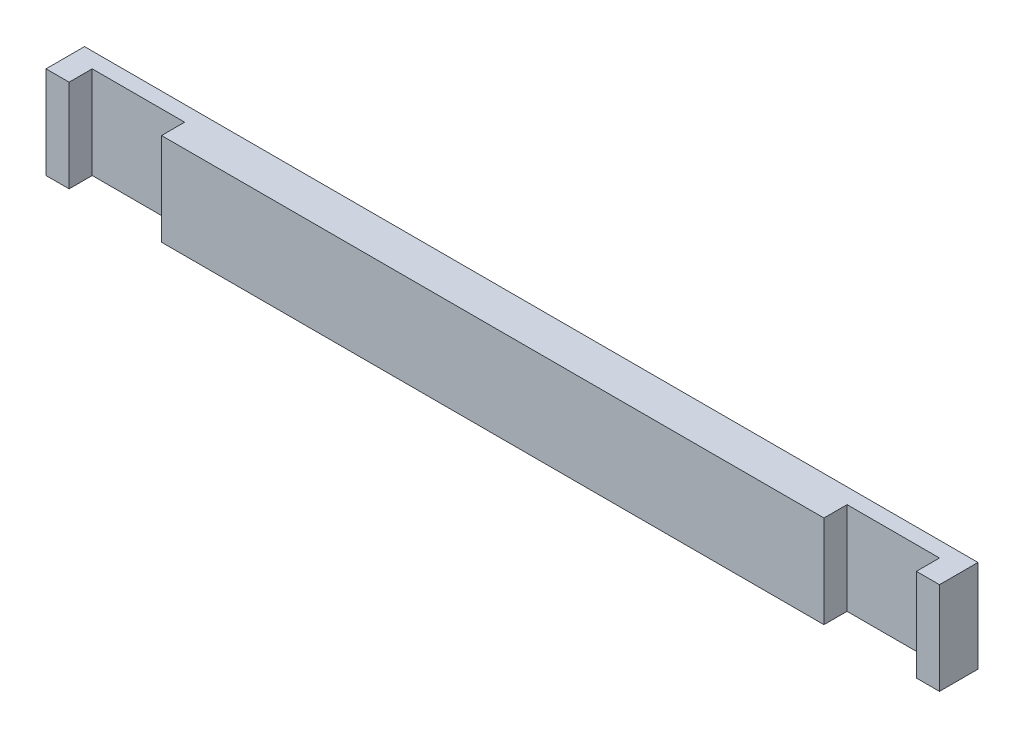
ISO-10303-21;
HEADER;
FILE_DESCRIPTION(('STEP AP214'),'2;1');
FILE_NAME('part.step','',(''),(''),'','','');
FILE_SCHEMA(('AUTOMOTIVE_DESIGN { 1 0 10303 214 1 1 1 1 }'));
ENDSEC;
DATA;
#1=APPLICATION_CONTEXT('core data for automotive mechanical design processes');
#2=APPLICATION_PROTOCOL_DEFINITION('international standard','automotive_design',2000,#1);
#3=PRODUCT_CONTEXT('',#1,'mechanical');
#4=PRODUCT('Part','Part','',(#3));
#5=PRODUCT_RELATED_PRODUCT_CATEGORY('part','',(#4));
#6=PRODUCT_DEFINITION_FORMATION('','',#4);
#7=PRODUCT_DEFINITION_CONTEXT('part definition',#1,'design');
#8=PRODUCT_DEFINITION('design','',#6,#7);
#9=PRODUCT_DEFINITION_SHAPE('','',#8);
#10=(LENGTH_UNIT() NAMED_UNIT(*) SI_UNIT(.MILLI.,.METRE.));
#11=(NAMED_UNIT(*) PLANE_ANGLE_UNIT() SI_UNIT($,.RADIAN.));
#12=(NAMED_UNIT(*) SI_UNIT($,.STERADIAN.) SOLID_ANGLE_UNIT());
#13=UNCERTAINTY_MEASURE_WITH_UNIT(LENGTH_MEASURE(1.E-05),#10,'distance_accuracy_value','');
#14=(GEOMETRIC_REPRESENTATION_CONTEXT(3) GLOBAL_UNCERTAINTY_ASSIGNED_CONTEXT((#13)) GLOBAL_UNIT_ASSIGNED_CONTEXT((#10,
#11,#12)) REPRESENTATION_CONTEXT('',''));
#15=CARTESIAN_POINT('',(0.,0.,0.));
#16=DIRECTION('',(0.,0.,1.));
#17=DIRECTION('',(1.,0.,0.));
#18=AXIS2_PLACEMENT_3D('',#15,#16,#17);
#19=CARTESIAN_POINT('',(-215.,60.,0.));
#20=DIRECTION('',(1.,0.,0.));
#21=DIRECTION('',(0.,0.,-1.));
#22=AXIS2_PLACEMENT_3D('',#19,#20,#21);
#23=PLANE('',#22);
#24=DIRECTION('',(0.,0.,1.));
#25=VECTOR('',#24,1.);
#26=CARTESIAN_POINT('',(-215.,0.,0.));
#27=LINE('',#26,#25);
#28=CARTESIAN_POINT('',(-215.,0.,-15.));
#29=VERTEX_POINT('',#28);
#30=CARTESIAN_POINT('',(-215.,0.,0.));
#31=VERTEX_POINT('',#30);
#32=EDGE_CURVE('E153',#29,#31,#27,.T.);
#33=ORIENTED_EDGE('',*,*,#32,.T.);
#34=DIRECTION('',(0.,-1.,0.));
#35=VECTOR('',#34,1.);
#36=CARTESIAN_POINT('',(-215.,60.,0.));
#37=LINE('',#36,#35);
#38=CARTESIAN_POINT('',(-215.,60.,0.));
#39=VERTEX_POINT('',#38);
#40=EDGE_CURVE('E11',#39,#31,#37,.T.);
#41=ORIENTED_EDGE('',*,*,#40,.F.);
#42=DIRECTION('',(0.,0.,1.));
#43=VECTOR('',#42,1.);
#44=CARTESIAN_POINT('',(-215.,60.,0.));
#45=LINE('',#44,#43);
#46=CARTESIAN_POINT('',(-215.,60.,-15.));
#47=VERTEX_POINT('',#46);
#48=EDGE_CURVE('E175',#47,#39,#45,.T.);
#49=ORIENTED_EDGE('',*,*,#48,.F.);
#50=DIRECTION('',(0.,-1.,0.));
#51=VECTOR('',#50,1.);
#52=CARTESIAN_POINT('',(-215.,60.,-15.));
#53=LINE('',#52,#51);
#54=EDGE_CURVE('E149',#47,#29,#53,.T.);
#55=ORIENTED_EDGE('',*,*,#54,.T.);
#56=EDGE_LOOP('',(#33,#41,#49,#55));
#57=FACE_BOUND('',#56,.T.);
#58=ADVANCED_FACE('F33',(#57),#23,.F.);
#59=CARTESIAN_POINT('',(215.,60.,0.));
#60=DIRECTION('',(0.,0.,-1.));
#61=DIRECTION('',(-1.,0.,0.));
#62=AXIS2_PLACEMENT_3D('',#59,#60,#61);
#63=PLANE('',#62);
#64=DIRECTION('',(1.,0.,0.));
#65=VECTOR('',#64,1.);
#66=CARTESIAN_POINT('',(215.,0.,0.));
#67=LINE('',#66,#65);
#68=CARTESIAN_POINT('',(215.,0.,0.));
#69=VERTEX_POINT('',#68);
#70=EDGE_CURVE('E156',#31,#69,#67,.T.);
#71=ORIENTED_EDGE('',*,*,#70,.T.);
#72=DIRECTION('',(0.,-1.,0.));
#73=VECTOR('',#72,1.);
#74=CARTESIAN_POINT('',(215.,60.,0.));
#75=LINE('',#74,#73);
#76=CARTESIAN_POINT('',(215.,60.,0.));
#77=VERTEX_POINT('',#76);
#78=EDGE_CURVE('E41',#77,#69,#75,.T.);
#79=ORIENTED_EDGE('',*,*,#78,.F.);
#80=DIRECTION('',(1.,0.,0.));
#81=VECTOR('',#80,1.);
#82=CARTESIAN_POINT('',(215.,60.,0.));
#83=LINE('',#82,#81);
#84=EDGE_CURVE('E104',#39,#77,#83,.T.);
#85=ORIENTED_EDGE('',*,*,#84,.F.);
#86=ORIENTED_EDGE('',*,*,#40,.T.);
#87=EDGE_LOOP('',(#71,#79,#85,#86));
#88=FACE_BOUND('',#87,.T.);
#89=ADVANCED_FACE('F253',(#88),#63,.F.);
#90=CARTESIAN_POINT('',(215.,60.,0.));
#91=DIRECTION('',(-1.,0.,0.));
#92=DIRECTION('',(0.,0.,1.));
#93=AXIS2_PLACEMENT_3D('',#90,#91,#92);
#94=PLANE('',#93);
#95=DIRECTION('',(0.,0.,-1.));
#96=VECTOR('',#95,1.);
#97=CARTESIAN_POINT('',(215.,0.,0.));
#98=LINE('',#97,#96);
#99=CARTESIAN_POINT('',(215.,0.,-15.));
#100=VERTEX_POINT('',#99);
#101=EDGE_CURVE('E158',#69,#100,#98,.T.);
#102=ORIENTED_EDGE('',*,*,#101,.T.);
#103=DIRECTION('',(0.,-1.,0.));
#104=VECTOR('',#103,1.);
#105=CARTESIAN_POINT('',(215.,60.,-15.));
#106=LINE('',#105,#104);
#107=CARTESIAN_POINT('',(215.,60.,-15.));
#108=VERTEX_POINT('',#107);
#109=EDGE_CURVE('E194',#108,#100,#106,.T.);
#110=ORIENTED_EDGE('',*,*,#109,.F.);
#111=DIRECTION('',(0.,0.,-1.));
#112=VECTOR('',#111,1.);
#113=CARTESIAN_POINT('',(215.,60.,0.));
#114=LINE('',#113,#112);
#115=EDGE_CURVE('E202',#77,#108,#114,.T.);
#116=ORIENTED_EDGE('',*,*,#115,.F.);
#117=ORIENTED_EDGE('',*,*,#78,.T.);
#118=EDGE_LOOP('',(#102,#110,#116,#117));
#119=FACE_BOUND('',#118,.T.);
#120=ADVANCED_FACE('F200',(#119),#94,.F.);
#121=CARTESIAN_POINT('',(215.,60.,-15.));
#122=DIRECTION('',(0.,0.,-1.));
#123=DIRECTION('',(-1.,0.,0.));
#124=AXIS2_PLACEMENT_3D('',#121,#122,#123);
#125=PLANE('',#124);
#126=DIRECTION('',(1.,0.,0.));
#127=VECTOR('',#126,1.);
#128=CARTESIAN_POINT('',(215.,0.,-15.));
#129=LINE('',#128,#127);
#130=CARTESIAN_POINT('',(275.,0.,-15.));
#131=VERTEX_POINT('',#130);
#132=EDGE_CURVE('E160',#100,#131,#129,.T.);
#133=ORIENTED_EDGE('',*,*,#132,.T.);
#134=DIRECTION('',(0.,-1.,0.));
#135=VECTOR('',#134,1.);
#136=CARTESIAN_POINT('',(275.,60.,-15.));
#137=LINE('',#136,#135);
#138=CARTESIAN_POINT('',(275.,60.,-15.));
#139=VERTEX_POINT('',#138);
#140=EDGE_CURVE('E191',#139,#131,#137,.T.);
#141=ORIENTED_EDGE('',*,*,#140,.F.);
#142=DIRECTION('',(1.,0.,0.));
#143=VECTOR('',#142,1.);
#144=CARTESIAN_POINT('',(215.,60.,-15.));
#145=LINE('',#144,#143);
#146=EDGE_CURVE('E220',#108,#139,#145,.T.);
#147=ORIENTED_EDGE('',*,*,#146,.F.);
#148=ORIENTED_EDGE('',*,*,#109,.T.);
#149=EDGE_LOOP('',(#133,#141,#147,#148));
#150=FACE_BOUND('',#149,.T.);
#151=ADVANCED_FACE('F211',(#150),#125,.F.);
#152=CARTESIAN_POINT('',(275.,60.,-15.));
#153=DIRECTION('',(1.,0.,0.));
#154=DIRECTION('',(0.,0.,-1.));
#155=AXIS2_PLACEMENT_3D('',#152,#153,#154);
#156=PLANE('',#155);
#157=DIRECTION('',(0.,0.,1.));
#158=VECTOR('',#157,1.);
#159=CARTESIAN_POINT('',(275.,0.,-15.));
#160=LINE('',#159,#158);
#161=CARTESIAN_POINT('',(275.,0.,0.));
#162=VERTEX_POINT('',#161);
#163=EDGE_CURVE('E162',#131,#162,#160,.T.);
#164=ORIENTED_EDGE('',*,*,#163,.T.);
#165=DIRECTION('',(0.,-1.,0.));
#166=VECTOR('',#165,1.);
#167=CARTESIAN_POINT('',(275.,60.,0.));
#168=LINE('',#167,#166);
#169=CARTESIAN_POINT('',(275.,60.,0.));
#170=VERTEX_POINT('',#169);
#171=EDGE_CURVE('E188',#170,#162,#168,.T.);
#172=ORIENTED_EDGE('',*,*,#171,.F.);
#173=DIRECTION('',(0.,0.,1.));
#174=VECTOR('',#173,1.);
#175=CARTESIAN_POINT('',(275.,60.,-15.));
#176=LINE('',#175,#174);
#177=EDGE_CURVE('E217',#139,#170,#176,.T.);
#178=ORIENTED_EDGE('',*,*,#177,.F.);
#179=ORIENTED_EDGE('',*,*,#140,.T.);
#180=EDGE_LOOP('',(#164,#172,#178,#179));
#181=FACE_BOUND('',#180,.T.);
#182=ADVANCED_FACE('F215',(#181),#156,.F.);
#183=CARTESIAN_POINT('',(275.,60.,0.));
#184=DIRECTION('',(0.,0.,-1.));
#185=DIRECTION('',(-1.,0.,0.));
#186=AXIS2_PLACEMENT_3D('',#183,#184,#185);
#187=PLANE('',#186);
#188=DIRECTION('',(1.,0.,0.));
#189=VECTOR('',#188,1.);
#190=CARTESIAN_POINT('',(275.,0.,0.));
#191=LINE('',#190,#189);
#192=CARTESIAN_POINT('',(290.,0.,0.));
#193=VERTEX_POINT('',#192);
#194=EDGE_CURVE('E164',#162,#193,#191,.T.);
#195=ORIENTED_EDGE('',*,*,#194,.T.);
#196=DIRECTION('',(0.,-1.,0.));
#197=VECTOR('',#196,1.);
#198=CARTESIAN_POINT('',(290.,60.,0.));
#199=LINE('',#198,#197);
#200=CARTESIAN_POINT('',(290.,60.,0.));
#201=VERTEX_POINT('',#200);
#202=EDGE_CURVE('E185',#201,#193,#199,.T.);
#203=ORIENTED_EDGE('',*,*,#202,.F.);
#204=DIRECTION('',(1.,0.,0.));
#205=VECTOR('',#204,1.);
#206=CARTESIAN_POINT('',(275.,60.,0.));
#207=LINE('',#206,#205);
#208=EDGE_CURVE('E219',#170,#201,#207,.T.);
#209=ORIENTED_EDGE('',*,*,#208,.F.);
#210=ORIENTED_EDGE('',*,*,#171,.T.);
#211=EDGE_LOOP('',(#195,#203,#209,#210));
#212=FACE_BOUND('',#211,.T.);
#213=ADVANCED_FACE('F266',(#212),#187,.F.);
#214=CARTESIAN_POINT('',(290.,60.,0.));
#215=DIRECTION('',(-1.,0.,0.));
#216=DIRECTION('',(0.,0.,1.));
#217=AXIS2_PLACEMENT_3D('',#214,#215,#216);
#218=PLANE('',#217);
#219=DIRECTION('',(0.,0.,-1.));
#220=VECTOR('',#219,1.);
#221=CARTESIAN_POINT('',(290.,0.,0.));
#222=LINE('',#221,#220);
#223=CARTESIAN_POINT('',(290.,0.,-25.));
#224=VERTEX_POINT('',#223);
#225=EDGE_CURVE('E166',#193,#224,#222,.T.);
#226=ORIENTED_EDGE('',*,*,#225,.T.);
#227=DIRECTION('',(0.,-1.,0.));
#228=VECTOR('',#227,1.);
#229=CARTESIAN_POINT('',(290.,60.,-25.));
#230=LINE('',#229,#228);
#231=CARTESIAN_POINT('',(290.,60.,-25.));
#232=VERTEX_POINT('',#231);
#233=EDGE_CURVE('E182',#232,#224,#230,.T.);
#234=ORIENTED_EDGE('',*,*,#233,.F.);
#235=DIRECTION('',(0.,0.,-1.));
#236=VECTOR('',#235,1.);
#237=CARTESIAN_POINT('',(290.,60.,0.));
#238=LINE('',#237,#236);
#239=EDGE_CURVE('E222',#201,#232,#238,.T.);
#240=ORIENTED_EDGE('',*,*,#239,.F.);
#241=ORIENTED_EDGE('',*,*,#202,.T.);
#242=EDGE_LOOP('',(#226,#234,#240,#241));
#243=FACE_BOUND('',#242,.T.);
#244=ADVANCED_FACE('F269',(#243),#218,.F.);
#245=CARTESIAN_POINT('',(-290.,60.,-25.));
#246=DIRECTION('',(0.,0.,1.));
#247=DIRECTION('',(1.,0.,0.));
#248=AXIS2_PLACEMENT_3D('',#245,#246,#247);
#249=PLANE('',#248);
#250=DIRECTION('',(-1.,0.,0.));
#251=VECTOR('',#250,1.);
#252=CARTESIAN_POINT('',(-290.,0.,-25.));
#253=LINE('',#252,#251);
#254=CARTESIAN_POINT('',(-290.,0.,-25.));
#255=VERTEX_POINT('',#254);
#256=EDGE_CURVE('E168',#224,#255,#253,.T.);
#257=ORIENTED_EDGE('',*,*,#256,.T.);
#258=DIRECTION('',(0.,-1.,0.));
#259=VECTOR('',#258,1.);
#260=CARTESIAN_POINT('',(-290.,60.,-25.));
#261=LINE('',#260,#259);
#262=CARTESIAN_POINT('',(-290.,60.,-25.));
#263=VERTEX_POINT('',#262);
#264=EDGE_CURVE('E179',#263,#255,#261,.T.);
#265=ORIENTED_EDGE('',*,*,#264,.F.);
#266=DIRECTION('',(-1.,0.,0.));
#267=VECTOR('',#266,1.);
#268=CARTESIAN_POINT('',(-290.,60.,-25.));
#269=LINE('',#268,#267);
#270=EDGE_CURVE('E228',#232,#263,#269,.T.);
#271=ORIENTED_EDGE('',*,*,#270,.F.);
#272=ORIENTED_EDGE('',*,*,#233,.T.);
#273=EDGE_LOOP('',(#257,#265,#271,#272));
#274=FACE_BOUND('',#273,.T.);
#275=ADVANCED_FACE('F234',(#274),#249,.F.);
#276=CARTESIAN_POINT('',(-290.,60.,0.));
#277=DIRECTION('',(1.,0.,0.));
#278=DIRECTION('',(0.,0.,-1.));
#279=AXIS2_PLACEMENT_3D('',#276,#277,#278);
#280=PLANE('',#279);
#281=DIRECTION('',(0.,0.,1.));
#282=VECTOR('',#281,1.);
#283=CARTESIAN_POINT('',(-290.,0.,0.));
#284=LINE('',#283,#282);
#285=CARTESIAN_POINT('',(-290.,0.,0.));
#286=VERTEX_POINT('',#285);
#287=EDGE_CURVE('E170',#255,#286,#284,.T.);
#288=ORIENTED_EDGE('',*,*,#287,.T.);
#289=DIRECTION('',(0.,-1.,0.));
#290=VECTOR('',#289,1.);
#291=CARTESIAN_POINT('',(-290.,60.,0.));
#292=LINE('',#291,#290);
#293=CARTESIAN_POINT('',(-290.,60.,0.));
#294=VERTEX_POINT('',#293);
#295=EDGE_CURVE('E144',#294,#286,#292,.T.);
#296=ORIENTED_EDGE('',*,*,#295,.F.);
#297=DIRECTION('',(0.,0.,1.));
#298=VECTOR('',#297,1.);
#299=CARTESIAN_POINT('',(-290.,60.,0.));
#300=LINE('',#299,#298);
#301=EDGE_CURVE('E135',#263,#294,#300,.T.);
#302=ORIENTED_EDGE('',*,*,#301,.F.);
#303=ORIENTED_EDGE('',*,*,#264,.T.);
#304=EDGE_LOOP('',(#288,#296,#302,#303));
#305=FACE_BOUND('',#304,.T.);
#306=ADVANCED_FACE('F238',(#305),#280,.F.);
#307=CARTESIAN_POINT('',(-275.,60.,0.));
#308=DIRECTION('',(0.,0.,-1.));
#309=DIRECTION('',(-1.,0.,0.));
#310=AXIS2_PLACEMENT_3D('',#307,#308,#309);
#311=PLANE('',#310);
#312=DIRECTION('',(1.,0.,0.));
#313=VECTOR('',#312,1.);
#314=CARTESIAN_POINT('',(-275.,0.,0.));
#315=LINE('',#314,#313);
#316=CARTESIAN_POINT('',(-275.,0.,0.));
#317=VERTEX_POINT('',#316);
#318=EDGE_CURVE('E143',#286,#317,#315,.T.);
#319=ORIENTED_EDGE('',*,*,#318,.T.);
#320=DIRECTION('',(0.,-1.,0.));
#321=VECTOR('',#320,1.);
#322=CARTESIAN_POINT('',(-275.,60.,0.));
#323=LINE('',#322,#321);
#324=CARTESIAN_POINT('',(-275.,60.,0.));
#325=VERTEX_POINT('',#324);
#326=EDGE_CURVE('E140',#325,#317,#323,.T.);
#327=ORIENTED_EDGE('',*,*,#326,.F.);
#328=DIRECTION('',(1.,0.,0.));
#329=VECTOR('',#328,1.);
#330=CARTESIAN_POINT('',(-275.,60.,0.));
#331=LINE('',#330,#329);
#332=EDGE_CURVE('E129',#294,#325,#331,.T.);
#333=ORIENTED_EDGE('',*,*,#332,.F.);
#334=ORIENTED_EDGE('',*,*,#295,.T.);
#335=EDGE_LOOP('',(#319,#327,#333,#334));
#336=FACE_BOUND('',#335,.T.);
#337=ADVANCED_FACE('F141',(#336),#311,.F.);
#338=CARTESIAN_POINT('',(-275.,60.,-15.));
#339=DIRECTION('',(-1.,0.,0.));
#340=DIRECTION('',(0.,0.,1.));
#341=AXIS2_PLACEMENT_3D('',#338,#339,#340);
#342=PLANE('',#341);
#343=DIRECTION('',(0.,0.,-1.));
#344=VECTOR('',#343,1.);
#345=CARTESIAN_POINT('',(-275.,0.,-15.));
#346=LINE('',#345,#344);
#347=CARTESIAN_POINT('',(-275.,0.,-15.));
#348=VERTEX_POINT('',#347);
#349=EDGE_CURVE('E90',#317,#348,#346,.T.);
#350=ORIENTED_EDGE('',*,*,#349,.T.);
#351=DIRECTION('',(0.,-1.,0.));
#352=VECTOR('',#351,1.);
#353=CARTESIAN_POINT('',(-275.,60.,-15.));
#354=LINE('',#353,#352);
#355=CARTESIAN_POINT('',(-275.,60.,-15.));
#356=VERTEX_POINT('',#355);
#357=EDGE_CURVE('E145',#356,#348,#354,.T.);
#358=ORIENTED_EDGE('',*,*,#357,.F.);
#359=DIRECTION('',(0.,0.,-1.));
#360=VECTOR('',#359,1.);
#361=CARTESIAN_POINT('',(-275.,60.,-15.));
#362=LINE('',#361,#360);
#363=EDGE_CURVE('E133',#325,#356,#362,.T.);
#364=ORIENTED_EDGE('',*,*,#363,.F.);
#365=ORIENTED_EDGE('',*,*,#326,.T.);
#366=EDGE_LOOP('',(#350,#358,#364,#365));
#367=FACE_BOUND('',#366,.T.);
#368=ADVANCED_FACE('F147',(#367),#342,.F.);
#369=CARTESIAN_POINT('',(-215.,60.,-15.));
#370=DIRECTION('',(0.,0.,-1.));
#371=DIRECTION('',(-1.,0.,0.));
#372=AXIS2_PLACEMENT_3D('',#369,#370,#371);
#373=PLANE('',#372);
#374=DIRECTION('',(1.,0.,0.));
#375=VECTOR('',#374,1.);
#376=CARTESIAN_POINT('',(-215.,0.,-15.));
#377=LINE('',#376,#375);
#378=EDGE_CURVE('E96',#348,#29,#377,.T.);
#379=ORIENTED_EDGE('',*,*,#378,.T.);
#380=ORIENTED_EDGE('',*,*,#54,.F.);
#381=DIRECTION('',(1.,0.,0.));
#382=VECTOR('',#381,1.);
#383=CARTESIAN_POINT('',(-215.,60.,-15.));
#384=LINE('',#383,#382);
#385=EDGE_CURVE('E49',#356,#47,#384,.T.);
#386=ORIENTED_EDGE('',*,*,#385,.F.);
#387=ORIENTED_EDGE('',*,*,#357,.T.);
#388=EDGE_LOOP('',(#379,#380,#386,#387));
#389=FACE_BOUND('',#388,.T.);
#390=ADVANCED_FACE('F242',(#389),#373,.F.);
#391=CARTESIAN_POINT('',(0.,60.,0.));
#392=DIRECTION('',(0.,1.,0.));
#393=DIRECTION('',(0.,0.,1.));
#394=AXIS2_PLACEMENT_3D('',#391,#392,#393);
#395=PLANE('',#394);
#396=ORIENTED_EDGE('',*,*,#48,.T.);
#397=ORIENTED_EDGE('',*,*,#84,.T.);
#398=ORIENTED_EDGE('',*,*,#115,.T.);
#399=ORIENTED_EDGE('',*,*,#146,.T.);
#400=ORIENTED_EDGE('',*,*,#177,.T.);
#401=ORIENTED_EDGE('',*,*,#208,.T.);
#402=ORIENTED_EDGE('',*,*,#239,.T.);
#403=ORIENTED_EDGE('',*,*,#270,.T.);
#404=ORIENTED_EDGE('',*,*,#301,.T.);
#405=ORIENTED_EDGE('',*,*,#332,.T.);
#406=ORIENTED_EDGE('',*,*,#363,.T.);
#407=ORIENTED_EDGE('',*,*,#385,.T.);
#408=EDGE_LOOP('',(#396,#397,#398,#399,#400,#401,#402,#403,#404,#405,#406,#407));
#409=FACE_BOUND('',#408,.T.);
#410=ADVANCED_FACE('F131',(#409),#395,.T.);
#411=CARTESIAN_POINT('',(0.,0.,0.));
#412=DIRECTION('',(0.,1.,0.));
#413=DIRECTION('',(0.,0.,1.));
#414=AXIS2_PLACEMENT_3D('',#411,#412,#413);
#415=PLANE('',#414);
#416=ORIENTED_EDGE('',*,*,#32,.F.);
#417=ORIENTED_EDGE('',*,*,#378,.F.);
#418=ORIENTED_EDGE('',*,*,#349,.F.);
#419=ORIENTED_EDGE('',*,*,#318,.F.);
#420=ORIENTED_EDGE('',*,*,#287,.F.);
#421=ORIENTED_EDGE('',*,*,#256,.F.);
#422=ORIENTED_EDGE('',*,*,#225,.F.);
#423=ORIENTED_EDGE('',*,*,#194,.F.);
#424=ORIENTED_EDGE('',*,*,#163,.F.);
#425=ORIENTED_EDGE('',*,*,#132,.F.);
#426=ORIENTED_EDGE('',*,*,#101,.F.);
#427=ORIENTED_EDGE('',*,*,#70,.F.);
#428=EDGE_LOOP('',(#416,#417,#418,#419,#420,#421,#422,#423,#424,#425,#426,#427));
#429=FACE_BOUND('',#428,.T.);
#430=ADVANCED_FACE('F206',(#429),#415,.F.);
#431=CLOSED_SHELL('',(#58,#89,#120,#151,#182,#213,#244,#275,#306,#337,#368,#390,#410,#430));
#432=MANIFOLD_SOLID_BREP('B2',#431);
#433=ADVANCED_BREP_SHAPE_REPRESENTATION('',(#18,#432),#14);
#434=SHAPE_DEFINITION_REPRESENTATION(#9,#433);
ENDSEC;
END-ISO-10303-21;
